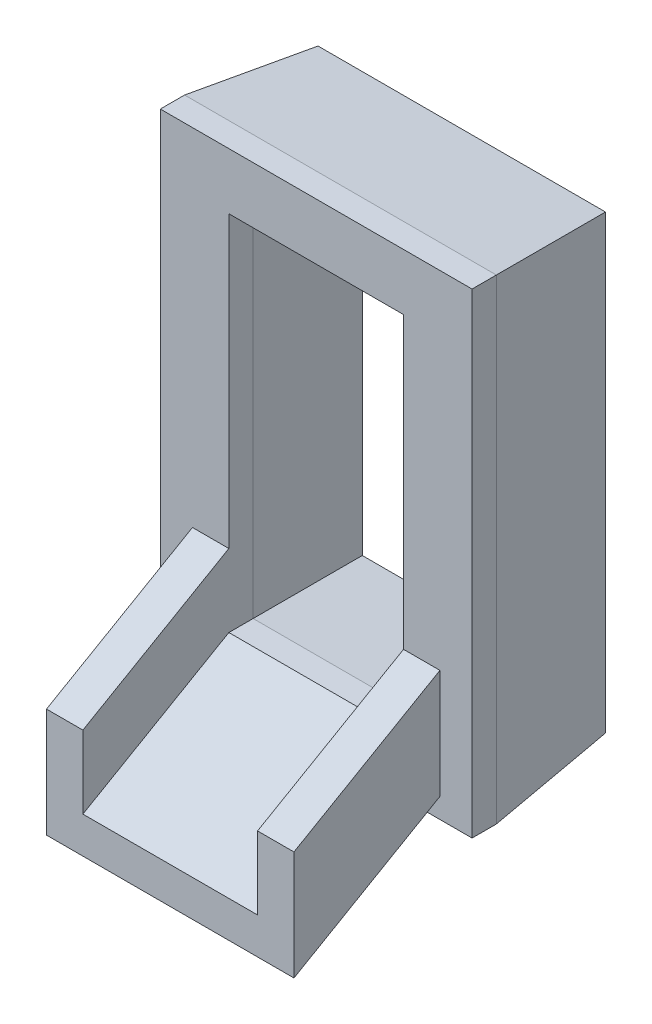
ISO-10303-21;
HEADER;
FILE_DESCRIPTION(('STEP AP214'),'2;1');
FILE_NAME('part.step','',(''),(''),'','','');
FILE_SCHEMA(('AUTOMOTIVE_DESIGN { 1 0 10303 214 1 1 1 1 }'));
ENDSEC;
DATA;
#1=APPLICATION_CONTEXT('core data for automotive mechanical design processes');
#2=APPLICATION_PROTOCOL_DEFINITION('international standard','automotive_design',2000,#1);
#3=PRODUCT_CONTEXT('',#1,'mechanical');
#4=PRODUCT('Part','Part','',(#3));
#5=PRODUCT_RELATED_PRODUCT_CATEGORY('part','',(#4));
#6=PRODUCT_DEFINITION_FORMATION('','',#4);
#7=PRODUCT_DEFINITION_CONTEXT('part definition',#1,'design');
#8=PRODUCT_DEFINITION('design','',#6,#7);
#9=PRODUCT_DEFINITION_SHAPE('','',#8);
#10=(LENGTH_UNIT() NAMED_UNIT(*) SI_UNIT(.MILLI.,.METRE.));
#11=(NAMED_UNIT(*) PLANE_ANGLE_UNIT() SI_UNIT($,.RADIAN.));
#12=(NAMED_UNIT(*) SI_UNIT($,.STERADIAN.) SOLID_ANGLE_UNIT());
#13=UNCERTAINTY_MEASURE_WITH_UNIT(LENGTH_MEASURE(1.E-05),#10,'distance_accuracy_value','');
#14=(GEOMETRIC_REPRESENTATION_CONTEXT(3) GLOBAL_UNCERTAINTY_ASSIGNED_CONTEXT((#13)) GLOBAL_UNIT_ASSIGNED_CONTEXT((#10,
#11,#12)) REPRESENTATION_CONTEXT('',''));
#15=CARTESIAN_POINT('',(0.,0.,0.));
#16=DIRECTION('',(0.,0.,1.));
#17=DIRECTION('',(1.,0.,0.));
#18=AXIS2_PLACEMENT_3D('',#15,#16,#17);
#19=CARTESIAN_POINT('',(0.,0.,12.));
#20=DIRECTION('',(0.,0.,-1.));
#21=DIRECTION('',(-1.,0.,0.));
#22=AXIS2_PLACEMENT_3D('',#19,#20,#21);
#23=PLANE('',#22);
#24=DIRECTION('',(0.,-1.,0.));
#25=VECTOR('',#24,1.);
#26=CARTESIAN_POINT('',(0.,0.,12.));
#27=LINE('',#26,#25);
#28=CARTESIAN_POINT('',(0.,39.2,12.));
#29=VERTEX_POINT('',#28);
#30=CARTESIAN_POINT('',(0.,0.,12.));
#31=VERTEX_POINT('',#30);
#32=EDGE_CURVE('E248',#29,#31,#27,.T.);
#33=ORIENTED_EDGE('',*,*,#32,.T.);
#34=DIRECTION('',(1.,0.,0.));
#35=VECTOR('',#34,1.);
#36=CARTESIAN_POINT('',(0.,0.,12.));
#37=LINE('',#36,#35);
#38=CARTESIAN_POINT('',(25.7,0.,12.));
#39=VERTEX_POINT('',#38);
#40=EDGE_CURVE('E251',#31,#39,#37,.T.);
#41=ORIENTED_EDGE('',*,*,#40,.T.);
#42=DIRECTION('',(0.,1.,0.));
#43=VECTOR('',#42,1.);
#44=CARTESIAN_POINT('',(25.7,0.,12.));
#45=LINE('',#44,#43);
#46=CARTESIAN_POINT('',(25.7,39.2,12.));
#47=VERTEX_POINT('',#46);
#48=EDGE_CURVE('E253',#39,#47,#45,.T.);
#49=ORIENTED_EDGE('',*,*,#48,.T.);
#50=DIRECTION('',(-1.,0.,0.));
#51=VECTOR('',#50,1.);
#52=CARTESIAN_POINT('',(0.,39.2,12.));
#53=LINE('',#52,#51);
#54=EDGE_CURVE('E255',#47,#29,#53,.T.);
#55=ORIENTED_EDGE('',*,*,#54,.T.);
#56=EDGE_LOOP('',(#33,#41,#49,#55));
#57=FACE_BOUND('',#56,.T.);
#58=DIRECTION('',(-1.,0.,0.));
#59=VECTOR('',#58,1.);
#60=CARTESIAN_POINT('',(23.05,10.65,12.));
#61=LINE('',#60,#59);
#62=CARTESIAN_POINT('',(23.05,10.65,12.));
#63=VERTEX_POINT('',#62);
#64=CARTESIAN_POINT('',(20.05,10.65,12.));
#65=VERTEX_POINT('',#64);
#66=EDGE_CURVE('E50',#63,#65,#61,.T.);
#67=ORIENTED_EDGE('',*,*,#66,.F.);
#68=DIRECTION('',(0.,1.,0.));
#69=VECTOR('',#68,1.);
#70=CARTESIAN_POINT('',(23.05,1.65,12.));
#71=LINE('',#70,#69);
#72=CARTESIAN_POINT('',(23.05,1.65,12.));
#73=VERTEX_POINT('',#72);
#74=EDGE_CURVE('E54',#73,#63,#71,.T.);
#75=ORIENTED_EDGE('',*,*,#74,.F.);
#76=DIRECTION('',(1.,0.,0.));
#77=VECTOR('',#76,1.);
#78=CARTESIAN_POINT('',(2.64999999999999,1.65,12.));
#79=LINE('',#78,#77);
#80=CARTESIAN_POINT('',(2.64999999999999,1.65,12.));
#81=VERTEX_POINT('',#80);
#82=EDGE_CURVE('E579',#81,#73,#79,.T.);
#83=ORIENTED_EDGE('',*,*,#82,.F.);
#84=DIRECTION('',(0.,-1.,0.));
#85=VECTOR('',#84,1.);
#86=CARTESIAN_POINT('',(2.64999999999999,10.65,12.));
#87=LINE('',#86,#85);
#88=CARTESIAN_POINT('',(2.64999999999999,10.65,12.));
#89=VERTEX_POINT('',#88);
#90=EDGE_CURVE('E578',#89,#81,#87,.T.);
#91=ORIENTED_EDGE('',*,*,#90,.F.);
#92=DIRECTION('',(-1.,0.,0.));
#93=VECTOR('',#92,1.);
#94=CARTESIAN_POINT('',(5.64999999999999,10.65,12.));
#95=LINE('',#94,#93);
#96=CARTESIAN_POINT('',(5.64999999999999,10.65,12.));
#97=VERTEX_POINT('',#96);
#98=EDGE_CURVE('E233',#97,#89,#95,.T.);
#99=ORIENTED_EDGE('',*,*,#98,.F.);
#100=DIRECTION('',(0.,-1.,0.));
#101=VECTOR('',#100,1.);
#102=CARTESIAN_POINT('',(5.64999999999999,4.65,12.));
#103=LINE('',#102,#101);
#104=CARTESIAN_POINT('',(5.64999999999999,34.55,12.));
#105=VERTEX_POINT('',#104);
#106=EDGE_CURVE('E189',#105,#97,#103,.T.);
#107=ORIENTED_EDGE('',*,*,#106,.F.);
#108=DIRECTION('',(-1.,0.,0.));
#109=VECTOR('',#108,1.);
#110=CARTESIAN_POINT('',(5.64999999999999,34.55,12.));
#111=LINE('',#110,#109);
#112=CARTESIAN_POINT('',(20.05,34.55,12.));
#113=VERTEX_POINT('',#112);
#114=EDGE_CURVE('E232',#113,#105,#111,.T.);
#115=ORIENTED_EDGE('',*,*,#114,.F.);
#116=DIRECTION('',(0.,1.,0.));
#117=VECTOR('',#116,1.);
#118=CARTESIAN_POINT('',(20.05,4.65,12.));
#119=LINE('',#118,#117);
#120=EDGE_CURVE('E231',#65,#113,#119,.T.);
#121=ORIENTED_EDGE('',*,*,#120,.F.);
#122=EDGE_LOOP('',(#67,#75,#83,#91,#99,#107,#115,#121));
#123=FACE_BOUND('',#122,.T.);
#124=ADVANCED_FACE('F33',(#57,#123),#23,.F.);
#125=CARTESIAN_POINT('',(0.,0.,0.));
#126=DIRECTION('',(0.,0.,-1.));
#127=DIRECTION('',(-1.,0.,0.));
#128=AXIS2_PLACEMENT_3D('',#125,#126,#127);
#129=PLANE('',#128);
#130=DIRECTION('',(0.,-1.,0.));
#131=VECTOR('',#130,1.);
#132=CARTESIAN_POINT('',(4.64999999999999,0.,0.));
#133=LINE('',#132,#131);
#134=CARTESIAN_POINT('',(4.64999999999999,35.55,0.));
#135=VERTEX_POINT('',#134);
#136=CARTESIAN_POINT('',(4.64999999999999,3.65,0.));
#137=VERTEX_POINT('',#136);
#138=EDGE_CURVE('E278',#135,#137,#133,.T.);
#139=ORIENTED_EDGE('',*,*,#138,.T.);
#140=DIRECTION('',(1.,0.,0.));
#141=VECTOR('',#140,1.);
#142=CARTESIAN_POINT('',(0.,3.65,0.));
#143=LINE('',#142,#141);
#144=CARTESIAN_POINT('',(21.05,3.65,0.));
#145=VERTEX_POINT('',#144);
#146=EDGE_CURVE('E284',#137,#145,#143,.T.);
#147=ORIENTED_EDGE('',*,*,#146,.T.);
#148=DIRECTION('',(0.,1.,0.));
#149=VECTOR('',#148,1.);
#150=CARTESIAN_POINT('',(21.05,0.,0.));
#151=LINE('',#150,#149);
#152=CARTESIAN_POINT('',(21.05,35.55,0.));
#153=VERTEX_POINT('',#152);
#154=EDGE_CURVE('E282',#145,#153,#151,.T.);
#155=ORIENTED_EDGE('',*,*,#154,.T.);
#156=DIRECTION('',(-1.,0.,0.));
#157=VECTOR('',#156,1.);
#158=CARTESIAN_POINT('',(0.,35.55,0.));
#159=LINE('',#158,#157);
#160=EDGE_CURVE('E280',#153,#135,#159,.T.);
#161=ORIENTED_EDGE('',*,*,#160,.T.);
#162=EDGE_LOOP('',(#139,#147,#155,#161));
#163=FACE_BOUND('',#162,.T.);
#164=DIRECTION('',(1.,0.,0.));
#165=VECTOR('',#164,1.);
#166=CARTESIAN_POINT('',(25.7,38.2,0.));
#167=LINE('',#166,#165);
#168=CARTESIAN_POINT('',(0.999999999999997,38.2,0.));
#169=VERTEX_POINT('',#168);
#170=CARTESIAN_POINT('',(24.7,38.2,0.));
#171=VERTEX_POINT('',#170);
#172=EDGE_CURVE('E273',#169,#171,#167,.T.);
#173=ORIENTED_EDGE('',*,*,#172,.T.);
#174=DIRECTION('',(0.,-1.,0.));
#175=VECTOR('',#174,1.);
#176=CARTESIAN_POINT('',(24.7,0.,0.));
#177=LINE('',#176,#175);
#178=CARTESIAN_POINT('',(24.7,1.,0.));
#179=VERTEX_POINT('',#178);
#180=EDGE_CURVE('E275',#171,#179,#177,.T.);
#181=ORIENTED_EDGE('',*,*,#180,.T.);
#182=DIRECTION('',(-1.,0.,0.));
#183=VECTOR('',#182,1.);
#184=CARTESIAN_POINT('',(0.,1.,0.));
#185=LINE('',#184,#183);
#186=CARTESIAN_POINT('',(1.,1.,0.));
#187=VERTEX_POINT('',#186);
#188=EDGE_CURVE('E269',#179,#187,#185,.T.);
#189=ORIENTED_EDGE('',*,*,#188,.T.);
#190=DIRECTION('',(0.,1.,0.));
#191=VECTOR('',#190,1.);
#192=CARTESIAN_POINT('',(0.999999999999997,39.2,0.));
#193=LINE('',#192,#191);
#194=EDGE_CURVE('E271',#187,#169,#193,.T.);
#195=ORIENTED_EDGE('',*,*,#194,.T.);
#196=EDGE_LOOP('',(#173,#181,#189,#195));
#197=FACE_BOUND('',#196,.T.);
#198=ADVANCED_FACE('F328',(#163,#197),#129,.T.);
#199=CARTESIAN_POINT('',(0.,0.,12.));
#200=DIRECTION('',(1.,0.,0.));
#201=DIRECTION('',(0.,1.,0.));
#202=AXIS2_PLACEMENT_3D('',#199,#200,#201);
#203=PLANE('',#202);
#204=DIRECTION('',(0.,0.,-1.));
#205=VECTOR('',#204,1.);
#206=CARTESIAN_POINT('',(0.,39.2,12.));
#207=LINE('',#206,#205);
#208=CARTESIAN_POINT('',(0.,39.2,10.0000000000004));
#209=VERTEX_POINT('',#208);
#210=EDGE_CURVE('E257',#29,#209,#207,.T.);
#211=ORIENTED_EDGE('',*,*,#210,.T.);
#212=DIRECTION('',(0.,-1.,0.));
#213=VECTOR('',#212,1.);
#214=CARTESIAN_POINT('',(0.,0.,10.0000000000004));
#215=LINE('',#214,#213);
#216=CARTESIAN_POINT('',(0.,0.,10.0000000000004));
#217=VERTEX_POINT('',#216);
#218=EDGE_CURVE('E42',#209,#217,#215,.T.);
#219=ORIENTED_EDGE('',*,*,#218,.T.);
#220=DIRECTION('',(0.,0.,-1.));
#221=VECTOR('',#220,1.);
#222=CARTESIAN_POINT('',(0.,0.,12.));
#223=LINE('',#222,#221);
#224=EDGE_CURVE('E266',#31,#217,#223,.T.);
#225=ORIENTED_EDGE('',*,*,#224,.F.);
#226=ORIENTED_EDGE('',*,*,#32,.F.);
#227=EDGE_LOOP('',(#211,#219,#225,#226));
#228=FACE_BOUND('',#227,.T.);
#229=ADVANCED_FACE('F350',(#228),#203,.F.);
#230=CARTESIAN_POINT('',(0.,0.,12.));
#231=DIRECTION('',(0.,1.,0.));
#232=DIRECTION('',(0.,0.,1.));
#233=AXIS2_PLACEMENT_3D('',#230,#231,#232);
#234=PLANE('',#233);
#235=ORIENTED_EDGE('',*,*,#224,.T.);
#236=DIRECTION('',(1.,0.,0.));
#237=VECTOR('',#236,1.);
#238=CARTESIAN_POINT('',(25.7,0.,10.0000000000004));
#239=LINE('',#238,#237);
#240=CARTESIAN_POINT('',(25.7,0.,10.0000000000004));
#241=VERTEX_POINT('',#240);
#242=EDGE_CURVE('E11',#217,#241,#239,.T.);
#243=ORIENTED_EDGE('',*,*,#242,.T.);
#244=DIRECTION('',(0.,0.,-1.));
#245=VECTOR('',#244,1.);
#246=CARTESIAN_POINT('',(25.7,0.,12.));
#247=LINE('',#246,#245);
#248=EDGE_CURVE('E263',#39,#241,#247,.T.);
#249=ORIENTED_EDGE('',*,*,#248,.F.);
#250=ORIENTED_EDGE('',*,*,#40,.F.);
#251=EDGE_LOOP('',(#235,#243,#249,#250));
#252=FACE_BOUND('',#251,.T.);
#253=ADVANCED_FACE('F348',(#252),#234,.F.);
#254=CARTESIAN_POINT('',(25.7,0.,12.));
#255=DIRECTION('',(-1.,0.,0.));
#256=DIRECTION('',(0.,-1.,0.));
#257=AXIS2_PLACEMENT_3D('',#254,#255,#256);
#258=PLANE('',#257);
#259=ORIENTED_EDGE('',*,*,#248,.T.);
#260=DIRECTION('',(0.,1.,0.));
#261=VECTOR('',#260,1.);
#262=CARTESIAN_POINT('',(25.7,39.2,10.0000000000004));
#263=LINE('',#262,#261);
#264=CARTESIAN_POINT('',(25.7,39.2,10.0000000000004));
#265=VERTEX_POINT('',#264);
#266=EDGE_CURVE('E296',#241,#265,#263,.T.);
#267=ORIENTED_EDGE('',*,*,#266,.T.);
#268=DIRECTION('',(0.,0.,-1.));
#269=VECTOR('',#268,1.);
#270=CARTESIAN_POINT('',(25.7,39.2,12.));
#271=LINE('',#270,#269);
#272=EDGE_CURVE('E260',#47,#265,#271,.T.);
#273=ORIENTED_EDGE('',*,*,#272,.F.);
#274=ORIENTED_EDGE('',*,*,#48,.F.);
#275=EDGE_LOOP('',(#259,#267,#273,#274));
#276=FACE_BOUND('',#275,.T.);
#277=ADVANCED_FACE('F339',(#276),#258,.F.);
#278=CARTESIAN_POINT('',(0.,39.2,12.));
#279=DIRECTION('',(0.,-1.,0.));
#280=DIRECTION('',(0.,0.,-1.));
#281=AXIS2_PLACEMENT_3D('',#278,#279,#280);
#282=PLANE('',#281);
#283=ORIENTED_EDGE('',*,*,#272,.T.);
#284=DIRECTION('',(-1.,0.,0.));
#285=VECTOR('',#284,1.);
#286=CARTESIAN_POINT('',(0.,39.2,10.0000000000004));
#287=LINE('',#286,#285);
#288=EDGE_CURVE('E299',#265,#209,#287,.T.);
#289=ORIENTED_EDGE('',*,*,#288,.T.);
#290=ORIENTED_EDGE('',*,*,#210,.F.);
#291=ORIENTED_EDGE('',*,*,#54,.F.);
#292=EDGE_LOOP('',(#283,#289,#290,#291));
#293=FACE_BOUND('',#292,.T.);
#294=ADVANCED_FACE('F343',(#293),#282,.F.);
#295=CARTESIAN_POINT('',(5.64999999999999,4.65,12.));
#296=DIRECTION('',(1.,0.,0.));
#297=DIRECTION('',(0.,0.,-1.));
#298=AXIS2_PLACEMENT_3D('',#295,#296,#297);
#299=PLANE('',#298);
#300=DIRECTION('',(0.,0.,-1.));
#301=VECTOR('',#300,1.);
#302=CARTESIAN_POINT('',(5.64999999999999,4.65,12.));
#303=LINE('',#302,#301);
#304=CARTESIAN_POINT('',(5.64999999999999,4.65,12.));
#305=VERTEX_POINT('',#304);
#306=CARTESIAN_POINT('',(5.64999999999999,4.65,10.));
#307=VERTEX_POINT('',#306);
#308=EDGE_CURVE('E246',#305,#307,#303,.T.);
#309=ORIENTED_EDGE('',*,*,#308,.T.);
#310=DIRECTION('',(0.,1.,0.));
#311=VECTOR('',#310,1.);
#312=CARTESIAN_POINT('',(5.64999999999999,4.65,10.));
#313=LINE('',#312,#311);
#314=CARTESIAN_POINT('',(5.64999999999999,34.55,10.));
#315=VERTEX_POINT('',#314);
#316=EDGE_CURVE('E294',#307,#315,#313,.T.);
#317=ORIENTED_EDGE('',*,*,#316,.T.);
#318=DIRECTION('',(0.,0.,-1.));
#319=VECTOR('',#318,1.);
#320=CARTESIAN_POINT('',(5.64999999999999,34.55,12.));
#321=LINE('',#320,#319);
#322=EDGE_CURVE('E237',#105,#315,#321,.T.);
#323=ORIENTED_EDGE('',*,*,#322,.F.);
#324=ORIENTED_EDGE('',*,*,#106,.T.);
#325=DIRECTION('',(0.,0.499999999999998,-0.86602540378444));
#326=VECTOR('',#325,1.);
#327=CARTESIAN_POINT('',(5.64999999999999,3.70255504250233,24.0333276491742));
#328=LINE('',#327,#326);
#329=CARTESIAN_POINT('',(5.64999999999999,3.70255504250233,24.0333276491742));
#330=VERTEX_POINT('',#329);
#331=EDGE_CURVE('E168',#330,#97,#328,.T.);
#332=ORIENTED_EDGE('',*,*,#331,.F.);
#333=DIRECTION('',(0.,1.,0.));
#334=VECTOR('',#333,1.);
#335=CARTESIAN_POINT('',(5.64999999999999,-2.29744495749767,24.0333276491742));
#336=LINE('',#335,#334);
#337=CARTESIAN_POINT('',(5.64999999999999,-2.29744495749767,24.0333276491742));
#338=VERTEX_POINT('',#337);
#339=EDGE_CURVE('E174',#338,#330,#336,.T.);
#340=ORIENTED_EDGE('',*,*,#339,.F.);
#341=DIRECTION('',(0.,0.499999999999998,-0.86602540378444));
#342=VECTOR('',#341,1.);
#343=CARTESIAN_POINT('',(5.64999999999999,-2.29744495749767,24.0333276491742));
#344=LINE('',#343,#342);
#345=EDGE_CURVE('E208',#338,#305,#344,.T.);
#346=ORIENTED_EDGE('',*,*,#345,.T.);
#347=EDGE_LOOP('',(#309,#317,#323,#324,#332,#340,#346));
#348=FACE_BOUND('',#347,.T.);
#349=ADVANCED_FACE('F186',(#348),#299,.T.);
#350=CARTESIAN_POINT('',(5.64999999999999,4.65,12.));
#351=DIRECTION('',(0.,1.,0.));
#352=DIRECTION('',(0.,0.,1.));
#353=AXIS2_PLACEMENT_3D('',#350,#351,#352);
#354=PLANE('',#353);
#355=DIRECTION('',(0.,0.,-1.));
#356=VECTOR('',#355,1.);
#357=CARTESIAN_POINT('',(20.05,4.65,12.));
#358=LINE('',#357,#356);
#359=CARTESIAN_POINT('',(20.05,4.65,12.));
#360=VERTEX_POINT('',#359);
#361=CARTESIAN_POINT('',(20.05,4.65,10.));
#362=VERTEX_POINT('',#361);
#363=EDGE_CURVE('E243',#360,#362,#358,.T.);
#364=ORIENTED_EDGE('',*,*,#363,.T.);
#365=DIRECTION('',(-1.,0.,0.));
#366=VECTOR('',#365,1.);
#367=CARTESIAN_POINT('',(5.64999999999999,4.65,10.));
#368=LINE('',#367,#366);
#369=EDGE_CURVE('E287',#362,#307,#368,.T.);
#370=ORIENTED_EDGE('',*,*,#369,.T.);
#371=ORIENTED_EDGE('',*,*,#308,.F.);
#372=DIRECTION('',(1.,0.,0.));
#373=VECTOR('',#372,1.);
#374=CARTESIAN_POINT('',(5.64999999999999,4.65,12.));
#375=LINE('',#374,#373);
#376=EDGE_CURVE('E223',#305,#360,#375,.T.);
#377=ORIENTED_EDGE('',*,*,#376,.T.);
#378=EDGE_LOOP('',(#364,#370,#371,#377));
#379=FACE_BOUND('',#378,.T.);
#380=ADVANCED_FACE('F535',(#379),#354,.T.);
#381=CARTESIAN_POINT('',(20.05,4.65,12.));
#382=DIRECTION('',(-1.,0.,0.));
#383=DIRECTION('',(0.,0.,1.));
#384=AXIS2_PLACEMENT_3D('',#381,#382,#383);
#385=PLANE('',#384);
#386=DIRECTION('',(0.,0.,-1.));
#387=VECTOR('',#386,1.);
#388=CARTESIAN_POINT('',(20.05,34.55,12.));
#389=LINE('',#388,#387);
#390=CARTESIAN_POINT('',(20.05,34.55,10.));
#391=VERTEX_POINT('',#390);
#392=EDGE_CURVE('E240',#113,#391,#389,.T.);
#393=ORIENTED_EDGE('',*,*,#392,.T.);
#394=DIRECTION('',(0.,-1.,0.));
#395=VECTOR('',#394,1.);
#396=CARTESIAN_POINT('',(20.05,4.65,10.));
#397=LINE('',#396,#395);
#398=EDGE_CURVE('E290',#391,#362,#397,.T.);
#399=ORIENTED_EDGE('',*,*,#398,.T.);
#400=ORIENTED_EDGE('',*,*,#363,.F.);
#401=DIRECTION('',(0.,0.499999999999998,-0.86602540378444));
#402=VECTOR('',#401,1.);
#403=CARTESIAN_POINT('',(20.05,-2.29744495749767,24.0333276491742));
#404=LINE('',#403,#402);
#405=CARTESIAN_POINT('',(20.05,-2.29744495749767,24.0333276491742));
#406=VERTEX_POINT('',#405);
#407=EDGE_CURVE('E210',#406,#360,#404,.T.);
#408=ORIENTED_EDGE('',*,*,#407,.F.);
#409=DIRECTION('',(0.,-1.,0.));
#410=VECTOR('',#409,1.);
#411=CARTESIAN_POINT('',(20.05,3.70255504250233,24.0333276491742));
#412=LINE('',#411,#410);
#413=CARTESIAN_POINT('',(20.05,3.70255504250233,24.0333276491742));
#414=VERTEX_POINT('',#413);
#415=EDGE_CURVE('E584',#414,#406,#412,.T.);
#416=ORIENTED_EDGE('',*,*,#415,.F.);
#417=DIRECTION('',(0.,0.499999999999998,-0.86602540378444));
#418=VECTOR('',#417,1.);
#419=CARTESIAN_POINT('',(20.05,3.70255504250233,24.0333276491742));
#420=LINE('',#419,#418);
#421=EDGE_CURVE('E203',#414,#65,#420,.T.);
#422=ORIENTED_EDGE('',*,*,#421,.T.);
#423=ORIENTED_EDGE('',*,*,#120,.T.);
#424=EDGE_LOOP('',(#393,#399,#400,#408,#416,#422,#423));
#425=FACE_BOUND('',#424,.T.);
#426=ADVANCED_FACE('F390',(#425),#385,.T.);
#427=CARTESIAN_POINT('',(5.64999999999999,34.55,12.));
#428=DIRECTION('',(0.,-1.,0.));
#429=DIRECTION('',(0.,0.,-1.));
#430=AXIS2_PLACEMENT_3D('',#427,#428,#429);
#431=PLANE('',#430);
#432=ORIENTED_EDGE('',*,*,#322,.T.);
#433=DIRECTION('',(1.,0.,0.));
#434=VECTOR('',#433,1.);
#435=CARTESIAN_POINT('',(5.64999999999999,34.55,10.));
#436=LINE('',#435,#434);
#437=EDGE_CURVE('E292',#315,#391,#436,.T.);
#438=ORIENTED_EDGE('',*,*,#437,.T.);
#439=ORIENTED_EDGE('',*,*,#392,.F.);
#440=ORIENTED_EDGE('',*,*,#114,.T.);
#441=EDGE_LOOP('',(#432,#438,#439,#440));
#442=FACE_BOUND('',#441,.T.);
#443=ADVANCED_FACE('F385',(#442),#431,.T.);
#444=CARTESIAN_POINT('',(0.,35.55,0.));
#445=DIRECTION('',(0.,0.995037190209989,0.099503719020999));
#446=DIRECTION('',(-1.,0.,0.));
#447=AXIS2_PLACEMENT_3D('',#444,#445,#446);
#448=PLANE('',#447);
#449=DIRECTION('',(-0.0990147542976675,-0.0990147542976675,0.990147542976675));
#450=VECTOR('',#449,1.);
#451=CARTESIAN_POINT('',(20.7014705882353,35.2014705882353,3.48529411764706));
#452=LINE('',#451,#450);
#453=EDGE_CURVE('E306',#391,#153,#452,.F.);
#454=ORIENTED_EDGE('',*,*,#453,.F.);
#455=ORIENTED_EDGE('',*,*,#437,.F.);
#456=DIRECTION('',(0.0990147542976675,-0.0990147542976675,0.990147542976675));
#457=VECTOR('',#456,1.);
#458=CARTESIAN_POINT('',(4.60441176470588,35.5955882352941,-0.455882352941176));
#459=LINE('',#458,#457);
#460=EDGE_CURVE('E228',#135,#315,#459,.T.);
#461=ORIENTED_EDGE('',*,*,#460,.F.);
#462=ORIENTED_EDGE('',*,*,#160,.F.);
#463=EDGE_LOOP('',(#454,#455,#461,#462));
#464=FACE_BOUND('',#463,.T.);
#465=ADVANCED_FACE('F389',(#464),#448,.F.);
#466=CARTESIAN_POINT('',(4.64999999999999,0.,0.));
#467=DIRECTION('',(-0.995037190209989,0.,0.0995037190209989));
#468=DIRECTION('',(0.,-1.,0.));
#469=AXIS2_PLACEMENT_3D('',#466,#467,#468);
#470=PLANE('',#469);
#471=ORIENTED_EDGE('',*,*,#460,.T.);
#472=ORIENTED_EDGE('',*,*,#316,.F.);
#473=DIRECTION('',(-0.0990147542976675,-0.0990147542976675,-0.990147542976675));
#474=VECTOR('',#473,1.);
#475=CARTESIAN_POINT('',(4.60441176470588,3.60441176470588,-0.455882352941176));
#476=LINE('',#475,#474);
#477=EDGE_CURVE('E304',#137,#307,#476,.F.);
#478=ORIENTED_EDGE('',*,*,#477,.F.);
#479=ORIENTED_EDGE('',*,*,#138,.F.);
#480=EDGE_LOOP('',(#471,#472,#478,#479));
#481=FACE_BOUND('',#480,.T.);
#482=ADVANCED_FACE('F400',(#481),#470,.F.);
#483=CARTESIAN_POINT('',(21.05,0.,0.));
#484=DIRECTION('',(0.995037190209989,0.,0.099503719020999));
#485=DIRECTION('',(0.,1.,0.));
#486=AXIS2_PLACEMENT_3D('',#483,#484,#485);
#487=PLANE('',#486);
#488=ORIENTED_EDGE('',*,*,#453,.T.);
#489=ORIENTED_EDGE('',*,*,#154,.F.);
#490=DIRECTION('',(-0.0990147542976675,0.0990147542976675,0.990147542976675));
#491=VECTOR('',#490,1.);
#492=CARTESIAN_POINT('',(20.8436274509804,3.85637254901961,2.06372549019608));
#493=LINE('',#492,#491);
#494=EDGE_CURVE('E302',#362,#145,#493,.F.);
#495=ORIENTED_EDGE('',*,*,#494,.F.);
#496=ORIENTED_EDGE('',*,*,#398,.F.);
#497=EDGE_LOOP('',(#488,#489,#495,#496));
#498=FACE_BOUND('',#497,.T.);
#499=ADVANCED_FACE('F411',(#498),#487,.F.);
#500=CARTESIAN_POINT('',(0.,3.65,0.));
#501=DIRECTION('',(0.,-0.995037190209989,0.0995037190209989));
#502=DIRECTION('',(1.,0.,0.));
#503=AXIS2_PLACEMENT_3D('',#500,#501,#502);
#504=PLANE('',#503);
#505=ORIENTED_EDGE('',*,*,#477,.T.);
#506=ORIENTED_EDGE('',*,*,#369,.F.);
#507=ORIENTED_EDGE('',*,*,#494,.T.);
#508=ORIENTED_EDGE('',*,*,#146,.F.);
#509=EDGE_LOOP('',(#505,#506,#507,#508));
#510=FACE_BOUND('',#509,.T.);
#511=ADVANCED_FACE('F421',(#510),#504,.F.);
#512=CARTESIAN_POINT('',(0.,0.,10.0000000000004));
#513=DIRECTION('',(-0.995037190209989,0.,-0.0995037190209955));
#514=DIRECTION('',(0.,1.,0.));
#515=AXIS2_PLACEMENT_3D('',#512,#513,#514);
#516=PLANE('',#515);
#517=DIRECTION('',(0.0990147542976641,-0.0990147542976641,-0.990147542976675));
#518=VECTOR('',#517,1.);
#519=CARTESIAN_POINT('',(0.384313725490167,38.8156862745098,6.15686274509852));
#520=LINE('',#519,#518);
#521=EDGE_CURVE('E311',#169,#209,#520,.F.);
#522=ORIENTED_EDGE('',*,*,#521,.F.);
#523=ORIENTED_EDGE('',*,*,#194,.F.);
#524=DIRECTION('',(0.0990147542976641,0.0990147542976641,-0.990147542976675));
#525=VECTOR('',#524,1.);
#526=CARTESIAN_POINT('',(0.,0.,10.0000000000004));
#527=LINE('',#526,#525);
#528=EDGE_CURVE('E229',#217,#187,#527,.T.);
#529=ORIENTED_EDGE('',*,*,#528,.F.);
#530=ORIENTED_EDGE('',*,*,#218,.F.);
#531=EDGE_LOOP('',(#522,#523,#529,#530));
#532=FACE_BOUND('',#531,.T.);
#533=ADVANCED_FACE('F35',(#532),#516,.T.);
#534=CARTESIAN_POINT('',(0.,0.,10.0000000000004));
#535=DIRECTION('',(0.,-0.995037190209989,-0.0995037190209955));
#536=DIRECTION('',(-1.,0.,0.));
#537=AXIS2_PLACEMENT_3D('',#534,#535,#536);
#538=PLANE('',#537);
#539=ORIENTED_EDGE('',*,*,#528,.T.);
#540=ORIENTED_EDGE('',*,*,#188,.F.);
#541=DIRECTION('',(0.0990147542976641,-0.0990147542976641,0.990147542976675));
#542=VECTOR('',#541,1.);
#543=CARTESIAN_POINT('',(25.4480392156863,0.251960784313708,7.48039215686318));
#544=LINE('',#543,#542);
#545=EDGE_CURVE('E192',#241,#179,#544,.F.);
#546=ORIENTED_EDGE('',*,*,#545,.F.);
#547=ORIENTED_EDGE('',*,*,#242,.F.);
#548=EDGE_LOOP('',(#539,#540,#546,#547));
#549=FACE_BOUND('',#548,.T.);
#550=ADVANCED_FACE('F322',(#549),#538,.T.);
#551=CARTESIAN_POINT('',(0.,39.2,10.0000000000004));
#552=DIRECTION('',(0.,0.995037190209989,-0.0995037190209955));
#553=DIRECTION('',(1.,0.,0.));
#554=AXIS2_PLACEMENT_3D('',#551,#552,#553);
#555=PLANE('',#554);
#556=ORIENTED_EDGE('',*,*,#521,.T.);
#557=ORIENTED_EDGE('',*,*,#288,.F.);
#558=DIRECTION('',(-0.0990147542976641,-0.0990147542976641,-0.990147542976675));
#559=VECTOR('',#558,1.);
#560=CARTESIAN_POINT('',(25.4480392156863,38.9480392156863,7.48039215686319));
#561=LINE('',#560,#559);
#562=EDGE_CURVE('E190',#171,#265,#561,.F.);
#563=ORIENTED_EDGE('',*,*,#562,.F.);
#564=ORIENTED_EDGE('',*,*,#172,.F.);
#565=EDGE_LOOP('',(#556,#557,#563,#564));
#566=FACE_BOUND('',#565,.T.);
#567=ADVANCED_FACE('F334',(#566),#555,.T.);
#568=CARTESIAN_POINT('',(25.7,0.,10.0000000000004));
#569=DIRECTION('',(0.995037190209989,0.,-0.0995037190209955));
#570=DIRECTION('',(0.,-1.,0.));
#571=AXIS2_PLACEMENT_3D('',#568,#569,#570);
#572=PLANE('',#571);
#573=ORIENTED_EDGE('',*,*,#545,.T.);
#574=ORIENTED_EDGE('',*,*,#180,.F.);
#575=ORIENTED_EDGE('',*,*,#562,.T.);
#576=ORIENTED_EDGE('',*,*,#266,.F.);
#577=EDGE_LOOP('',(#573,#574,#575,#576));
#578=FACE_BOUND('',#577,.T.);
#579=ADVANCED_FACE('F332',(#578),#572,.T.);
#580=CARTESIAN_POINT('',(5.64999999999999,3.70255504250233,24.0333276491742));
#581=DIRECTION('',(0.,-0.86602540378444,-0.499999999999998));
#582=DIRECTION('',(0.,0.499999999999998,-0.86602540378444));
#583=AXIS2_PLACEMENT_3D('',#580,#581,#582);
#584=PLANE('',#583);
#585=ORIENTED_EDGE('',*,*,#98,.T.);
#586=DIRECTION('',(0.,0.499999999999998,-0.86602540378444));
#587=VECTOR('',#586,1.);
#588=CARTESIAN_POINT('',(2.64999999999999,3.70255504250233,24.0333276491742));
#589=LINE('',#588,#587);
#590=CARTESIAN_POINT('',(2.64999999999999,3.70255504250233,24.0333276491742));
#591=VERTEX_POINT('',#590);
#592=EDGE_CURVE('E170',#591,#89,#589,.T.);
#593=ORIENTED_EDGE('',*,*,#592,.F.);
#594=DIRECTION('',(-1.,0.,0.));
#595=VECTOR('',#594,1.);
#596=CARTESIAN_POINT('',(5.64999999999999,3.70255504250233,24.0333276491742));
#597=LINE('',#596,#595);
#598=EDGE_CURVE('E163',#330,#591,#597,.T.);
#599=ORIENTED_EDGE('',*,*,#598,.F.);
#600=ORIENTED_EDGE('',*,*,#331,.T.);
#601=EDGE_LOOP('',(#585,#593,#599,#600));
#602=FACE_BOUND('',#601,.T.);
#603=ADVANCED_FACE('F166',(#602),#584,.F.);
#604=CARTESIAN_POINT('',(2.64999999999999,3.70255504250233,24.0333276491742));
#605=DIRECTION('',(1.,0.,0.));
#606=DIRECTION('',(0.,1.,0.));
#607=AXIS2_PLACEMENT_3D('',#604,#605,#606);
#608=PLANE('',#607);
#609=ORIENTED_EDGE('',*,*,#90,.T.);
#610=DIRECTION('',(0.,0.499999999999998,-0.86602540378444));
#611=VECTOR('',#610,1.);
#612=CARTESIAN_POINT('',(2.64999999999999,-5.29744495749767,24.0333276491742));
#613=LINE('',#612,#611);
#614=CARTESIAN_POINT('',(2.64999999999999,-5.29744495749767,24.0333276491742));
#615=VERTEX_POINT('',#614);
#616=EDGE_CURVE('E194',#615,#81,#613,.T.);
#617=ORIENTED_EDGE('',*,*,#616,.F.);
#618=DIRECTION('',(0.,-1.,0.));
#619=VECTOR('',#618,1.);
#620=CARTESIAN_POINT('',(2.64999999999999,3.70255504250233,24.0333276491742));
#621=LINE('',#620,#619);
#622=EDGE_CURVE('E173',#591,#615,#621,.T.);
#623=ORIENTED_EDGE('',*,*,#622,.F.);
#624=ORIENTED_EDGE('',*,*,#592,.T.);
#625=EDGE_LOOP('',(#609,#617,#623,#624));
#626=FACE_BOUND('',#625,.T.);
#627=ADVANCED_FACE('F467',(#626),#608,.F.);
#628=CARTESIAN_POINT('',(2.64999999999999,-5.29744495749767,24.0333276491742));
#629=DIRECTION('',(0.,0.86602540378444,0.499999999999998));
#630=DIRECTION('',(0.,-0.499999999999998,0.86602540378444));
#631=AXIS2_PLACEMENT_3D('',#628,#629,#630);
#632=PLANE('',#631);
#633=ORIENTED_EDGE('',*,*,#82,.T.);
#634=DIRECTION('',(0.,0.499999999999998,-0.86602540378444));
#635=VECTOR('',#634,1.);
#636=CARTESIAN_POINT('',(23.05,-5.29744495749767,24.0333276491742));
#637=LINE('',#636,#635);
#638=CARTESIAN_POINT('',(23.05,-5.29744495749767,24.0333276491742));
#639=VERTEX_POINT('',#638);
#640=EDGE_CURVE('E216',#639,#73,#637,.T.);
#641=ORIENTED_EDGE('',*,*,#640,.F.);
#642=DIRECTION('',(1.,0.,0.));
#643=VECTOR('',#642,1.);
#644=CARTESIAN_POINT('',(2.64999999999999,-5.29744495749767,24.0333276491742));
#645=LINE('',#644,#643);
#646=EDGE_CURVE('E590',#615,#639,#645,.T.);
#647=ORIENTED_EDGE('',*,*,#646,.F.);
#648=ORIENTED_EDGE('',*,*,#616,.T.);
#649=EDGE_LOOP('',(#633,#641,#647,#648));
#650=FACE_BOUND('',#649,.T.);
#651=ADVANCED_FACE('F475',(#650),#632,.F.);
#652=CARTESIAN_POINT('',(23.05,-5.29744495749767,24.0333276491742));
#653=DIRECTION('',(-1.,0.,0.));
#654=DIRECTION('',(0.,0.,1.));
#655=AXIS2_PLACEMENT_3D('',#652,#653,#654);
#656=PLANE('',#655);
#657=ORIENTED_EDGE('',*,*,#74,.T.);
#658=DIRECTION('',(0.,0.499999999999998,-0.86602540378444));
#659=VECTOR('',#658,1.);
#660=CARTESIAN_POINT('',(23.05,3.70255504250233,24.0333276491742));
#661=LINE('',#660,#659);
#662=CARTESIAN_POINT('',(23.05,3.70255504250233,24.0333276491742));
#663=VERTEX_POINT('',#662);
#664=EDGE_CURVE('E213',#663,#63,#661,.T.);
#665=ORIENTED_EDGE('',*,*,#664,.F.);
#666=DIRECTION('',(0.,1.,0.));
#667=VECTOR('',#666,1.);
#668=CARTESIAN_POINT('',(23.05,-5.29744495749767,24.0333276491742));
#669=LINE('',#668,#667);
#670=EDGE_CURVE('E588',#639,#663,#669,.T.);
#671=ORIENTED_EDGE('',*,*,#670,.F.);
#672=ORIENTED_EDGE('',*,*,#640,.T.);
#673=EDGE_LOOP('',(#657,#665,#671,#672));
#674=FACE_BOUND('',#673,.T.);
#675=ADVANCED_FACE('F483',(#674),#656,.F.);
#676=CARTESIAN_POINT('',(23.05,3.70255504250233,24.0333276491742));
#677=DIRECTION('',(0.,-0.86602540378444,-0.499999999999998));
#678=DIRECTION('',(0.,0.499999999999998,-0.86602540378444));
#679=AXIS2_PLACEMENT_3D('',#676,#677,#678);
#680=PLANE('',#679);
#681=ORIENTED_EDGE('',*,*,#66,.T.);
#682=ORIENTED_EDGE('',*,*,#421,.F.);
#683=DIRECTION('',(-1.,0.,0.));
#684=VECTOR('',#683,1.);
#685=CARTESIAN_POINT('',(23.05,3.70255504250233,24.0333276491742));
#686=LINE('',#685,#684);
#687=EDGE_CURVE('E586',#663,#414,#686,.T.);
#688=ORIENTED_EDGE('',*,*,#687,.F.);
#689=ORIENTED_EDGE('',*,*,#664,.T.);
#690=EDGE_LOOP('',(#681,#682,#688,#689));
#691=FACE_BOUND('',#690,.T.);
#692=ADVANCED_FACE('F491',(#691),#680,.F.);
#693=CARTESIAN_POINT('',(20.05,-2.29744495749767,24.0333276491742));
#694=DIRECTION('',(0.,-0.86602540378444,-0.499999999999998));
#695=DIRECTION('',(0.,0.499999999999998,-0.86602540378444));
#696=AXIS2_PLACEMENT_3D('',#693,#694,#695);
#697=PLANE('',#696);
#698=ORIENTED_EDGE('',*,*,#376,.F.);
#699=ORIENTED_EDGE('',*,*,#345,.F.);
#700=DIRECTION('',(-1.,0.,0.));
#701=VECTOR('',#700,1.);
#702=CARTESIAN_POINT('',(20.05,-2.29744495749767,24.0333276491742));
#703=LINE('',#702,#701);
#704=EDGE_CURVE('E179',#406,#338,#703,.T.);
#705=ORIENTED_EDGE('',*,*,#704,.F.);
#706=ORIENTED_EDGE('',*,*,#407,.T.);
#707=EDGE_LOOP('',(#698,#699,#705,#706));
#708=FACE_BOUND('',#707,.T.);
#709=ADVANCED_FACE('F499',(#708),#697,.F.);
#710=CARTESIAN_POINT('',(0.,-6.94744495749767,24.0333276491742));
#711=DIRECTION('',(0.,0.,1.));
#712=DIRECTION('',(1.,0.,0.));
#713=AXIS2_PLACEMENT_3D('',#710,#711,#712);
#714=PLANE('',#713);
#715=ORIENTED_EDGE('',*,*,#339,.T.);
#716=ORIENTED_EDGE('',*,*,#598,.T.);
#717=ORIENTED_EDGE('',*,*,#622,.T.);
#718=ORIENTED_EDGE('',*,*,#646,.T.);
#719=ORIENTED_EDGE('',*,*,#670,.T.);
#720=ORIENTED_EDGE('',*,*,#687,.T.);
#721=ORIENTED_EDGE('',*,*,#415,.T.);
#722=ORIENTED_EDGE('',*,*,#704,.T.);
#723=EDGE_LOOP('',(#715,#716,#717,#718,#719,#720,#721,#722));
#724=FACE_BOUND('',#723,.T.);
#725=ADVANCED_FACE('F177',(#724),#714,.T.);
#726=CLOSED_SHELL('',(#124,#198,#229,#253,#277,#294,#349,#380,#426,#443,#465,#482,#499,#511,
#533,#550,#567,#579,#603,#627,#651,#675,#692,#709,#725));
#727=MANIFOLD_SOLID_BREP('B2',#726);
#728=ADVANCED_BREP_SHAPE_REPRESENTATION('',(#18,#727),#14);
#729=SHAPE_DEFINITION_REPRESENTATION(#9,#728);
ENDSEC;
END-ISO-10303-21;
